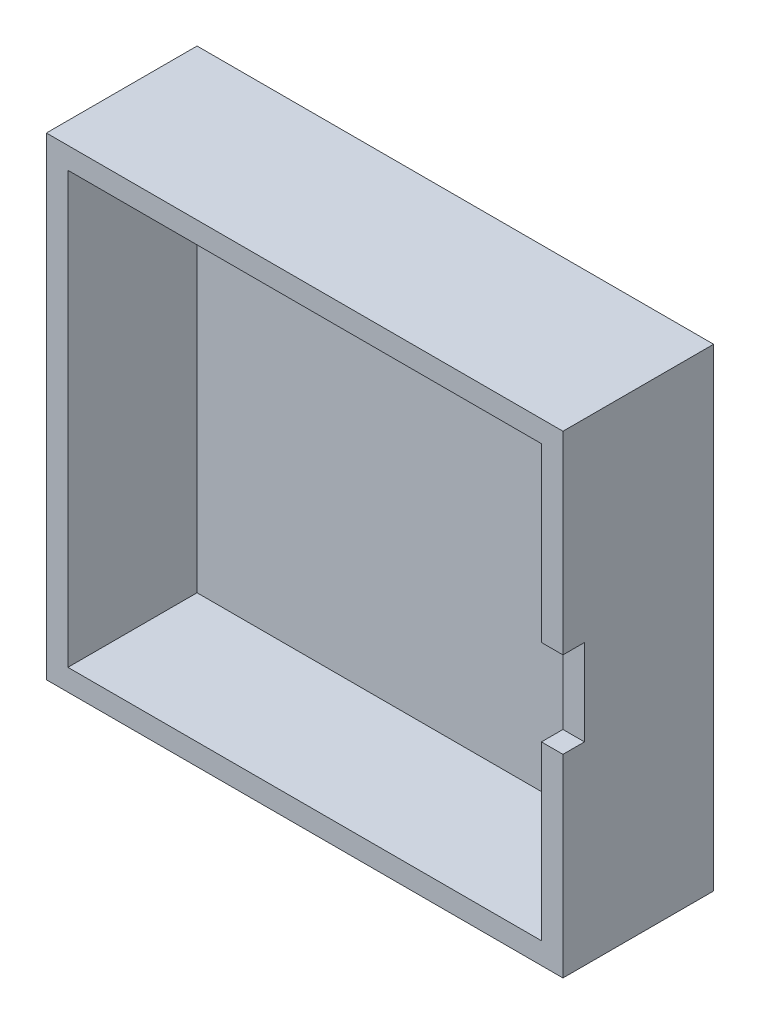
ISO-10303-21;
HEADER;
FILE_DESCRIPTION(('STEP AP214'),'2;1');
FILE_NAME('part.step','',(''),(''),'','','');
FILE_SCHEMA(('AUTOMOTIVE_DESIGN { 1 0 10303 214 1 1 1 1 }'));
ENDSEC;
DATA;
#1=APPLICATION_CONTEXT('core data for automotive mechanical design processes');
#2=APPLICATION_PROTOCOL_DEFINITION('international standard','automotive_design',2000,#1);
#3=PRODUCT_CONTEXT('',#1,'mechanical');
#4=PRODUCT('Part','Part','',(#3));
#5=PRODUCT_RELATED_PRODUCT_CATEGORY('part','',(#4));
#6=PRODUCT_DEFINITION_FORMATION('','',#4);
#7=PRODUCT_DEFINITION_CONTEXT('part definition',#1,'design');
#8=PRODUCT_DEFINITION('design','',#6,#7);
#9=PRODUCT_DEFINITION_SHAPE('','',#8);
#10=(LENGTH_UNIT() NAMED_UNIT(*) SI_UNIT(.MILLI.,.METRE.));
#11=(NAMED_UNIT(*) PLANE_ANGLE_UNIT() SI_UNIT($,.RADIAN.));
#12=(NAMED_UNIT(*) SI_UNIT($,.STERADIAN.) SOLID_ANGLE_UNIT());
#13=UNCERTAINTY_MEASURE_WITH_UNIT(LENGTH_MEASURE(1.E-05),#10,'distance_accuracy_value','');
#14=(GEOMETRIC_REPRESENTATION_CONTEXT(3) GLOBAL_UNCERTAINTY_ASSIGNED_CONTEXT((#13)) GLOBAL_UNIT_ASSIGNED_CONTEXT((#10,
#11,#12)) REPRESENTATION_CONTEXT('',''));
#15=CARTESIAN_POINT('',(0.,0.,0.));
#16=DIRECTION('',(0.,0.,1.));
#17=DIRECTION('',(1.,0.,0.));
#18=AXIS2_PLACEMENT_3D('',#15,#16,#17);
#19=CARTESIAN_POINT('',(-10.,210.,60.));
#20=DIRECTION('',(0.,0.,-1.));
#21=DIRECTION('',(-1.,0.,0.));
#22=AXIS2_PLACEMENT_3D('',#19,#20,#21);
#23=PLANE('',#22);
#24=DIRECTION('',(1.,0.,0.));
#25=VECTOR('',#24,1.);
#26=CARTESIAN_POINT('',(220.,120.,60.));
#27=LINE('',#26,#25);
#28=CARTESIAN_POINT('',(220.,120.,60.));
#29=VERTEX_POINT('',#28);
#30=CARTESIAN_POINT('',(230.,120.,60.));
#31=VERTEX_POINT('',#30);
#32=EDGE_CURVE('E125',#29,#31,#27,.T.);
#33=ORIENTED_EDGE('',*,*,#32,.T.);
#34=DIRECTION('',(0.,1.,0.));
#35=VECTOR('',#34,1.);
#36=CARTESIAN_POINT('',(230.,-10.,60.));
#37=LINE('',#36,#35);
#38=CARTESIAN_POINT('',(230.,210.,60.));
#39=VERTEX_POINT('',#38);
#40=EDGE_CURVE('E177',#31,#39,#37,.T.);
#41=ORIENTED_EDGE('',*,*,#40,.T.);
#42=DIRECTION('',(-1.,0.,0.));
#43=VECTOR('',#42,1.);
#44=CARTESIAN_POINT('',(-10.,210.,60.));
#45=LINE('',#44,#43);
#46=CARTESIAN_POINT('',(-10.,210.,60.));
#47=VERTEX_POINT('',#46);
#48=EDGE_CURVE('E181',#39,#47,#45,.T.);
#49=ORIENTED_EDGE('',*,*,#48,.T.);
#50=DIRECTION('',(0.,-1.,0.));
#51=VECTOR('',#50,1.);
#52=CARTESIAN_POINT('',(-10.,-10.,60.));
#53=LINE('',#52,#51);
#54=CARTESIAN_POINT('',(-10.,-10.,60.));
#55=VERTEX_POINT('',#54);
#56=EDGE_CURVE('E172',#47,#55,#53,.T.);
#57=ORIENTED_EDGE('',*,*,#56,.T.);
#58=DIRECTION('',(1.,0.,0.));
#59=VECTOR('',#58,1.);
#60=CARTESIAN_POINT('',(-10.,-10.,60.));
#61=LINE('',#60,#59);
#62=CARTESIAN_POINT('',(230.,-10.,60.));
#63=VERTEX_POINT('',#62);
#64=EDGE_CURVE('E175',#55,#63,#61,.T.);
#65=ORIENTED_EDGE('',*,*,#64,.T.);
#66=CARTESIAN_POINT('',(230.,80.,60.));
#67=VERTEX_POINT('',#66);
#68=EDGE_CURVE('E178',#63,#67,#37,.T.);
#69=ORIENTED_EDGE('',*,*,#68,.T.);
#70=DIRECTION('',(1.,0.,0.));
#71=VECTOR('',#70,1.);
#72=CARTESIAN_POINT('',(220.,80.,60.));
#73=LINE('',#72,#71);
#74=CARTESIAN_POINT('',(220.,80.,60.));
#75=VERTEX_POINT('',#74);
#76=EDGE_CURVE('E224',#75,#67,#73,.T.);
#77=ORIENTED_EDGE('',*,*,#76,.F.);
#78=DIRECTION('',(0.,1.,0.));
#79=VECTOR('',#78,1.);
#80=CARTESIAN_POINT('',(220.,0.,60.));
#81=LINE('',#80,#79);
#82=CARTESIAN_POINT('',(220.,0.,60.));
#83=VERTEX_POINT('',#82);
#84=EDGE_CURVE('E141',#83,#75,#81,.T.);
#85=ORIENTED_EDGE('',*,*,#84,.F.);
#86=DIRECTION('',(1.,0.,0.));
#87=VECTOR('',#86,1.);
#88=CARTESIAN_POINT('',(0.,0.,60.));
#89=LINE('',#88,#87);
#90=CARTESIAN_POINT('',(0.,0.,60.));
#91=VERTEX_POINT('',#90);
#92=EDGE_CURVE('E142',#91,#83,#89,.T.);
#93=ORIENTED_EDGE('',*,*,#92,.F.);
#94=DIRECTION('',(0.,-1.,0.));
#95=VECTOR('',#94,1.);
#96=CARTESIAN_POINT('',(0.,0.,60.));
#97=LINE('',#96,#95);
#98=CARTESIAN_POINT('',(0.,200.,60.));
#99=VERTEX_POINT('',#98);
#100=EDGE_CURVE('E145',#99,#91,#97,.T.);
#101=ORIENTED_EDGE('',*,*,#100,.F.);
#102=DIRECTION('',(-1.,0.,0.));
#103=VECTOR('',#102,1.);
#104=CARTESIAN_POINT('',(0.,200.,60.));
#105=LINE('',#104,#103);
#106=CARTESIAN_POINT('',(220.,200.,60.));
#107=VERTEX_POINT('',#106);
#108=EDGE_CURVE('E140',#107,#99,#105,.T.);
#109=ORIENTED_EDGE('',*,*,#108,.F.);
#110=EDGE_CURVE('E58',#29,#107,#81,.T.);
#111=ORIENTED_EDGE('',*,*,#110,.F.);
#112=EDGE_LOOP('',(#33,#41,#49,#57,#65,#69,#77,#85,#93,#101,#109,#111));
#113=FACE_BOUND('',#112,.T.);
#114=ADVANCED_FACE('F35',(#113),#23,.F.);
#115=CARTESIAN_POINT('',(230.,-10.,60.));
#116=DIRECTION('',(-1.,0.,0.));
#117=DIRECTION('',(0.,0.,1.));
#118=AXIS2_PLACEMENT_3D('',#115,#116,#117);
#119=PLANE('',#118);
#120=DIRECTION('',(0.,0.,1.));
#121=VECTOR('',#120,1.);
#122=CARTESIAN_POINT('',(230.,120.,60.));
#123=LINE('',#122,#121);
#124=CARTESIAN_POINT('',(230.,120.,50.));
#125=VERTEX_POINT('',#124);
#126=EDGE_CURVE('E130',#125,#31,#123,.T.);
#127=ORIENTED_EDGE('',*,*,#126,.F.);
#128=DIRECTION('',(0.,1.,0.));
#129=VECTOR('',#128,1.);
#130=CARTESIAN_POINT('',(230.,-10.,50.));
#131=LINE('',#130,#129);
#132=CARTESIAN_POINT('',(230.,80.,50.));
#133=VERTEX_POINT('',#132);
#134=EDGE_CURVE('E264',#133,#125,#131,.T.);
#135=ORIENTED_EDGE('',*,*,#134,.F.);
#136=DIRECTION('',(0.,0.,-1.));
#137=VECTOR('',#136,1.);
#138=CARTESIAN_POINT('',(230.,80.,60.));
#139=LINE('',#138,#137);
#140=EDGE_CURVE('E136',#67,#133,#139,.T.);
#141=ORIENTED_EDGE('',*,*,#140,.F.);
#142=ORIENTED_EDGE('',*,*,#68,.F.);
#143=DIRECTION('',(0.,0.,-1.));
#144=VECTOR('',#143,1.);
#145=CARTESIAN_POINT('',(230.,-10.,60.));
#146=LINE('',#145,#144);
#147=CARTESIAN_POINT('',(230.,-10.,-10.));
#148=VERTEX_POINT('',#147);
#149=EDGE_CURVE('E43',#63,#148,#146,.T.);
#150=ORIENTED_EDGE('',*,*,#149,.T.);
#151=DIRECTION('',(0.,1.,0.));
#152=VECTOR('',#151,1.);
#153=CARTESIAN_POINT('',(230.,-153.380438887107,-10.));
#154=LINE('',#153,#152);
#155=CARTESIAN_POINT('',(230.,210.,-10.));
#156=VERTEX_POINT('',#155);
#157=EDGE_CURVE('E193',#148,#156,#154,.T.);
#158=ORIENTED_EDGE('',*,*,#157,.T.);
#159=DIRECTION('',(0.,0.,-1.));
#160=VECTOR('',#159,1.);
#161=CARTESIAN_POINT('',(230.,210.,60.));
#162=LINE('',#161,#160);
#163=EDGE_CURVE('E185',#39,#156,#162,.T.);
#164=ORIENTED_EDGE('',*,*,#163,.F.);
#165=ORIENTED_EDGE('',*,*,#40,.F.);
#166=EDGE_LOOP('',(#127,#135,#141,#142,#150,#158,#164,#165));
#167=FACE_BOUND('',#166,.T.);
#168=ADVANCED_FACE('F191',(#167),#119,.F.);
#169=CARTESIAN_POINT('',(220.,0.,60.));
#170=DIRECTION('',(-1.,0.,0.));
#171=DIRECTION('',(0.,0.,1.));
#172=AXIS2_PLACEMENT_3D('',#169,#170,#171);
#173=PLANE('',#172);
#174=DIRECTION('',(0.,-1.,0.));
#175=VECTOR('',#174,1.);
#176=CARTESIAN_POINT('',(220.,120.,50.));
#177=LINE('',#176,#175);
#178=CARTESIAN_POINT('',(220.,120.,50.));
#179=VERTEX_POINT('',#178);
#180=CARTESIAN_POINT('',(220.,80.,50.));
#181=VERTEX_POINT('',#180);
#182=EDGE_CURVE('E50',#179,#181,#177,.T.);
#183=ORIENTED_EDGE('',*,*,#182,.F.);
#184=DIRECTION('',(0.,0.,-1.));
#185=VECTOR('',#184,1.);
#186=CARTESIAN_POINT('',(220.,120.,60.));
#187=LINE('',#186,#185);
#188=EDGE_CURVE('E128',#29,#179,#187,.T.);
#189=ORIENTED_EDGE('',*,*,#188,.F.);
#190=ORIENTED_EDGE('',*,*,#110,.T.);
#191=DIRECTION('',(0.,0.,-1.));
#192=VECTOR('',#191,1.);
#193=CARTESIAN_POINT('',(220.,200.,60.));
#194=LINE('',#193,#192);
#195=CARTESIAN_POINT('',(220.,200.,0.));
#196=VERTEX_POINT('',#195);
#197=EDGE_CURVE('E165',#107,#196,#194,.T.);
#198=ORIENTED_EDGE('',*,*,#197,.T.);
#199=DIRECTION('',(0.,1.,0.));
#200=VECTOR('',#199,1.);
#201=CARTESIAN_POINT('',(220.,0.,0.));
#202=LINE('',#201,#200);
#203=CARTESIAN_POINT('',(220.,0.,0.));
#204=VERTEX_POINT('',#203);
#205=EDGE_CURVE('E158',#204,#196,#202,.T.);
#206=ORIENTED_EDGE('',*,*,#205,.F.);
#207=DIRECTION('',(0.,0.,-1.));
#208=VECTOR('',#207,1.);
#209=CARTESIAN_POINT('',(220.,0.,60.));
#210=LINE('',#209,#208);
#211=EDGE_CURVE('E167',#83,#204,#210,.T.);
#212=ORIENTED_EDGE('',*,*,#211,.F.);
#213=ORIENTED_EDGE('',*,*,#84,.T.);
#214=DIRECTION('',(0.,0.,1.));
#215=VECTOR('',#214,1.);
#216=CARTESIAN_POINT('',(220.,80.,50.));
#217=LINE('',#216,#215);
#218=EDGE_CURVE('E225',#181,#75,#217,.T.);
#219=ORIENTED_EDGE('',*,*,#218,.F.);
#220=EDGE_LOOP('',(#183,#189,#190,#198,#206,#212,#213,#219));
#221=FACE_BOUND('',#220,.T.);
#222=ADVANCED_FACE('F134',(#221),#173,.T.);
#223=CARTESIAN_POINT('',(-10.,-10.,60.));
#224=DIRECTION('',(1.,0.,0.));
#225=DIRECTION('',(0.,0.,-1.));
#226=AXIS2_PLACEMENT_3D('',#223,#224,#225);
#227=PLANE('',#226);
#228=DIRECTION('',(0.,0.,-1.));
#229=VECTOR('',#228,1.);
#230=CARTESIAN_POINT('',(-10.,210.,60.));
#231=LINE('',#230,#229);
#232=CARTESIAN_POINT('',(-9.99999999999999,210.,-10.));
#233=VERTEX_POINT('',#232);
#234=EDGE_CURVE('E183',#47,#233,#231,.T.);
#235=ORIENTED_EDGE('',*,*,#234,.T.);
#236=DIRECTION('',(0.,1.,0.));
#237=VECTOR('',#236,1.);
#238=CARTESIAN_POINT('',(-9.99999999999999,-153.380438887107,-10.));
#239=LINE('',#238,#237);
#240=CARTESIAN_POINT('',(-9.99999999999999,-10.,-10.));
#241=VERTEX_POINT('',#240);
#242=EDGE_CURVE('E208',#241,#233,#239,.T.);
#243=ORIENTED_EDGE('',*,*,#242,.F.);
#244=DIRECTION('',(0.,0.,-1.));
#245=VECTOR('',#244,1.);
#246=CARTESIAN_POINT('',(-10.,-10.,60.));
#247=LINE('',#246,#245);
#248=EDGE_CURVE('E11',#55,#241,#247,.T.);
#249=ORIENTED_EDGE('',*,*,#248,.F.);
#250=ORIENTED_EDGE('',*,*,#56,.F.);
#251=EDGE_LOOP('',(#235,#243,#249,#250));
#252=FACE_BOUND('',#251,.T.);
#253=ADVANCED_FACE('F37',(#252),#227,.F.);
#254=CARTESIAN_POINT('',(-10.,-10.,60.));
#255=DIRECTION('',(0.,1.,0.));
#256=DIRECTION('',(0.,0.,1.));
#257=AXIS2_PLACEMENT_3D('',#254,#255,#256);
#258=PLANE('',#257);
#259=ORIENTED_EDGE('',*,*,#248,.T.);
#260=DIRECTION('',(1.,0.,0.));
#261=VECTOR('',#260,1.);
#262=CARTESIAN_POINT('',(110.,-10.,-10.));
#263=LINE('',#262,#261);
#264=EDGE_CURVE('E202',#241,#148,#263,.T.);
#265=ORIENTED_EDGE('',*,*,#264,.T.);
#266=ORIENTED_EDGE('',*,*,#149,.F.);
#267=ORIENTED_EDGE('',*,*,#64,.F.);
#268=EDGE_LOOP('',(#259,#265,#266,#267));
#269=FACE_BOUND('',#268,.T.);
#270=ADVANCED_FACE('F205',(#269),#258,.F.);
#271=CARTESIAN_POINT('',(-10.,210.,60.));
#272=DIRECTION('',(0.,-1.,0.));
#273=DIRECTION('',(0.,0.,-1.));
#274=AXIS2_PLACEMENT_3D('',#271,#272,#273);
#275=PLANE('',#274);
#276=ORIENTED_EDGE('',*,*,#163,.T.);
#277=DIRECTION('',(1.,0.,0.));
#278=VECTOR('',#277,1.);
#279=CARTESIAN_POINT('',(110.,210.,-10.));
#280=LINE('',#279,#278);
#281=EDGE_CURVE('E155',#233,#156,#280,.T.);
#282=ORIENTED_EDGE('',*,*,#281,.F.);
#283=ORIENTED_EDGE('',*,*,#234,.F.);
#284=ORIENTED_EDGE('',*,*,#48,.F.);
#285=EDGE_LOOP('',(#276,#282,#283,#284));
#286=FACE_BOUND('',#285,.T.);
#287=ADVANCED_FACE('F249',(#286),#275,.F.);
#288=CARTESIAN_POINT('',(0.,0.,60.));
#289=DIRECTION('',(1.,0.,0.));
#290=DIRECTION('',(0.,0.,-1.));
#291=AXIS2_PLACEMENT_3D('',#288,#289,#290);
#292=PLANE('',#291);
#293=DIRECTION('',(0.,-1.,0.));
#294=VECTOR('',#293,1.);
#295=CARTESIAN_POINT('',(0.,0.,0.));
#296=LINE('',#295,#294);
#297=CARTESIAN_POINT('',(0.,200.,0.));
#298=VERTEX_POINT('',#297);
#299=CARTESIAN_POINT('',(0.,0.,0.));
#300=VERTEX_POINT('',#299);
#301=EDGE_CURVE('E151',#298,#300,#296,.T.);
#302=ORIENTED_EDGE('',*,*,#301,.F.);
#303=DIRECTION('',(0.,0.,-1.));
#304=VECTOR('',#303,1.);
#305=CARTESIAN_POINT('',(0.,200.,60.));
#306=LINE('',#305,#304);
#307=EDGE_CURVE('E150',#99,#298,#306,.T.);
#308=ORIENTED_EDGE('',*,*,#307,.F.);
#309=ORIENTED_EDGE('',*,*,#100,.T.);
#310=DIRECTION('',(0.,0.,-1.));
#311=VECTOR('',#310,1.);
#312=CARTESIAN_POINT('',(0.,0.,60.));
#313=LINE('',#312,#311);
#314=EDGE_CURVE('E169',#91,#300,#313,.T.);
#315=ORIENTED_EDGE('',*,*,#314,.T.);
#316=EDGE_LOOP('',(#302,#308,#309,#315));
#317=FACE_BOUND('',#316,.T.);
#318=ADVANCED_FACE('F217',(#317),#292,.T.);
#319=CARTESIAN_POINT('',(0.,0.,60.));
#320=DIRECTION('',(0.,1.,0.));
#321=DIRECTION('',(0.,0.,1.));
#322=AXIS2_PLACEMENT_3D('',#319,#320,#321);
#323=PLANE('',#322);
#324=DIRECTION('',(1.,0.,0.));
#325=VECTOR('',#324,1.);
#326=CARTESIAN_POINT('',(0.,0.,0.));
#327=LINE('',#326,#325);
#328=EDGE_CURVE('E154',#300,#204,#327,.T.);
#329=ORIENTED_EDGE('',*,*,#328,.F.);
#330=ORIENTED_EDGE('',*,*,#314,.F.);
#331=ORIENTED_EDGE('',*,*,#92,.T.);
#332=ORIENTED_EDGE('',*,*,#211,.T.);
#333=EDGE_LOOP('',(#329,#330,#331,#332));
#334=FACE_BOUND('',#333,.T.);
#335=ADVANCED_FACE('F220',(#334),#323,.T.);
#336=CARTESIAN_POINT('',(0.,200.,60.));
#337=DIRECTION('',(0.,-1.,0.));
#338=DIRECTION('',(0.,0.,-1.));
#339=AXIS2_PLACEMENT_3D('',#336,#337,#338);
#340=PLANE('',#339);
#341=DIRECTION('',(-1.,0.,0.));
#342=VECTOR('',#341,1.);
#343=CARTESIAN_POINT('',(0.,200.,0.));
#344=LINE('',#343,#342);
#345=EDGE_CURVE('E161',#196,#298,#344,.T.);
#346=ORIENTED_EDGE('',*,*,#345,.F.);
#347=ORIENTED_EDGE('',*,*,#197,.F.);
#348=ORIENTED_EDGE('',*,*,#108,.T.);
#349=ORIENTED_EDGE('',*,*,#307,.T.);
#350=EDGE_LOOP('',(#346,#347,#348,#349));
#351=FACE_BOUND('',#350,.T.);
#352=ADVANCED_FACE('F231',(#351),#340,.T.);
#353=CARTESIAN_POINT('',(110.,-153.380438887107,0.));
#354=DIRECTION('',(0.,0.,1.));
#355=DIRECTION('',(1.,0.,0.));
#356=AXIS2_PLACEMENT_3D('',#353,#354,#355);
#357=PLANE('',#356);
#358=ORIENTED_EDGE('',*,*,#345,.T.);
#359=ORIENTED_EDGE('',*,*,#301,.T.);
#360=ORIENTED_EDGE('',*,*,#328,.T.);
#361=ORIENTED_EDGE('',*,*,#205,.T.);
#362=EDGE_LOOP('',(#358,#359,#360,#361));
#363=FACE_BOUND('',#362,.T.);
#364=ADVANCED_FACE('F229',(#363),#357,.T.);
#365=CARTESIAN_POINT('',(110.,-153.380438887107,-10.));
#366=DIRECTION('',(0.,0.,1.));
#367=DIRECTION('',(1.,0.,0.));
#368=AXIS2_PLACEMENT_3D('',#365,#366,#367);
#369=PLANE('',#368);
#370=ORIENTED_EDGE('',*,*,#242,.T.);
#371=ORIENTED_EDGE('',*,*,#281,.T.);
#372=ORIENTED_EDGE('',*,*,#157,.F.);
#373=ORIENTED_EDGE('',*,*,#264,.F.);
#374=EDGE_LOOP('',(#370,#371,#372,#373));
#375=FACE_BOUND('',#374,.T.);
#376=ADVANCED_FACE('F201',(#375),#369,.F.);
#377=CARTESIAN_POINT('',(220.,120.,60.));
#378=DIRECTION('',(0.,-1.,0.));
#379=DIRECTION('',(0.,0.,-1.));
#380=AXIS2_PLACEMENT_3D('',#377,#378,#379);
#381=PLANE('',#380);
#382=DIRECTION('',(1.,0.,0.));
#383=VECTOR('',#382,1.);
#384=CARTESIAN_POINT('',(220.,120.,50.));
#385=LINE('',#384,#383);
#386=EDGE_CURVE('E268',#179,#125,#385,.T.);
#387=ORIENTED_EDGE('',*,*,#386,.T.);
#388=ORIENTED_EDGE('',*,*,#126,.T.);
#389=ORIENTED_EDGE('',*,*,#32,.F.);
#390=ORIENTED_EDGE('',*,*,#188,.T.);
#391=EDGE_LOOP('',(#387,#388,#389,#390));
#392=FACE_BOUND('',#391,.T.);
#393=ADVANCED_FACE('F127',(#392),#381,.T.);
#394=CARTESIAN_POINT('',(220.,120.,50.));
#395=DIRECTION('',(0.,0.,1.));
#396=DIRECTION('',(0.,-1.,0.));
#397=AXIS2_PLACEMENT_3D('',#394,#395,#396);
#398=PLANE('',#397);
#399=DIRECTION('',(1.,0.,0.));
#400=VECTOR('',#399,1.);
#401=CARTESIAN_POINT('',(220.,80.,50.));
#402=LINE('',#401,#400);
#403=EDGE_CURVE('E270',#181,#133,#402,.T.);
#404=ORIENTED_EDGE('',*,*,#403,.T.);
#405=ORIENTED_EDGE('',*,*,#134,.T.);
#406=ORIENTED_EDGE('',*,*,#386,.F.);
#407=ORIENTED_EDGE('',*,*,#182,.T.);
#408=EDGE_LOOP('',(#404,#405,#406,#407));
#409=FACE_BOUND('',#408,.T.);
#410=ADVANCED_FACE('F276',(#409),#398,.T.);
#411=CARTESIAN_POINT('',(220.,80.,50.));
#412=DIRECTION('',(0.,1.,0.));
#413=DIRECTION('',(0.,0.,1.));
#414=AXIS2_PLACEMENT_3D('',#411,#412,#413);
#415=PLANE('',#414);
#416=ORIENTED_EDGE('',*,*,#76,.T.);
#417=ORIENTED_EDGE('',*,*,#140,.T.);
#418=ORIENTED_EDGE('',*,*,#403,.F.);
#419=ORIENTED_EDGE('',*,*,#218,.T.);
#420=EDGE_LOOP('',(#416,#417,#418,#419));
#421=FACE_BOUND('',#420,.T.);
#422=ADVANCED_FACE('F275',(#421),#415,.T.);
#423=CLOSED_SHELL('',(#114,#168,#222,#253,#270,#287,#318,#335,#352,#364,#376,#393,#410,#422));
#424=MANIFOLD_SOLID_BREP('B2',#423);
#425=ADVANCED_BREP_SHAPE_REPRESENTATION('',(#18,#424),#14);
#426=SHAPE_DEFINITION_REPRESENTATION(#9,#425);
ENDSEC;
END-ISO-10303-21;
